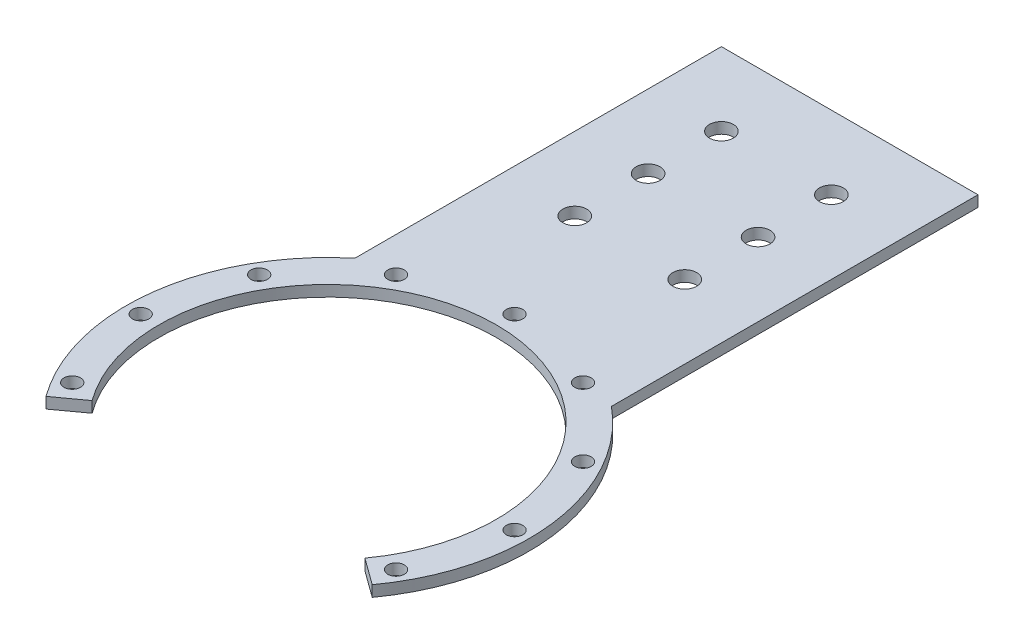
ISO-10303-21;
HEADER;
FILE_DESCRIPTION(('STEP AP214'),'2;1');
FILE_NAME('part.step','',(''),(''),'','','');
FILE_SCHEMA(('AUTOMOTIVE_DESIGN { 1 0 10303 214 1 1 1 1 }'));
ENDSEC;
DATA;
#1=APPLICATION_CONTEXT('core data for automotive mechanical design processes');
#2=APPLICATION_PROTOCOL_DEFINITION('international standard','automotive_design',2000,#1);
#3=PRODUCT_CONTEXT('',#1,'mechanical');
#4=PRODUCT('Part','Part','',(#3));
#5=PRODUCT_RELATED_PRODUCT_CATEGORY('part','',(#4));
#6=PRODUCT_DEFINITION_FORMATION('','',#4);
#7=PRODUCT_DEFINITION_CONTEXT('part definition',#1,'design');
#8=PRODUCT_DEFINITION('design','',#6,#7);
#9=PRODUCT_DEFINITION_SHAPE('','',#8);
#10=(LENGTH_UNIT() NAMED_UNIT(*) SI_UNIT(.MILLI.,.METRE.));
#11=(NAMED_UNIT(*) PLANE_ANGLE_UNIT() SI_UNIT($,.RADIAN.));
#12=(NAMED_UNIT(*) SI_UNIT($,.STERADIAN.) SOLID_ANGLE_UNIT());
#13=UNCERTAINTY_MEASURE_WITH_UNIT(LENGTH_MEASURE(1.E-05),#10,'distance_accuracy_value','');
#14=(GEOMETRIC_REPRESENTATION_CONTEXT(3) GLOBAL_UNCERTAINTY_ASSIGNED_CONTEXT((#13)) GLOBAL_UNIT_ASSIGNED_CONTEXT((#10,
#11,#12)) REPRESENTATION_CONTEXT('',''));
#15=CARTESIAN_POINT('',(0.,0.,0.));
#16=DIRECTION('',(0.,0.,1.));
#17=DIRECTION('',(1.,0.,0.));
#18=AXIS2_PLACEMENT_3D('',#15,#16,#17);
#19=CARTESIAN_POINT('',(-15.,-0.000287499999999594,-82.4264068711929));
#20=DIRECTION('',(0.,1.,0.));
#21=DIRECTION('',(0.,0.,1.));
#22=AXIS2_PLACEMENT_3D('',#19,#20,#21);
#23=CYLINDRICAL_SURFACE('',#22,3.25);
#24=CARTESIAN_POINT('',(-15.,3.,-82.4264068711929));
#25=DIRECTION('',(0.,1.,0.));
#26=DIRECTION('',(0.,0.,1.));
#27=AXIS2_PLACEMENT_3D('',#24,#25,#26);
#28=CIRCLE('',#27,3.25);
#29=CARTESIAN_POINT('',(-15.,3.,-79.1764068711929));
#30=VERTEX_POINT('',#29);
#31=EDGE_CURVE('E39',#30,#30,#28,.T.);
#32=ORIENTED_EDGE('',*,*,#31,.T.);
#33=EDGE_LOOP('',(#32));
#34=FACE_BOUND('',#33,.T.);
#35=CARTESIAN_POINT('',(-15.,0.,-82.4264068711929));
#36=DIRECTION('',(0.,1.,0.));
#37=DIRECTION('',(0.,0.,1.));
#38=AXIS2_PLACEMENT_3D('',#35,#36,#37);
#39=CIRCLE('',#38,3.25);
#40=CARTESIAN_POINT('',(-15.,0.,-79.1764068711929));
#41=VERTEX_POINT('',#40);
#42=EDGE_CURVE('E11',#41,#41,#39,.T.);
#43=ORIENTED_EDGE('',*,*,#42,.F.);
#44=EDGE_LOOP('',(#43));
#45=FACE_BOUND('',#44,.T.);
#46=ADVANCED_FACE('F32',(#34,#45),#23,.F.);
#47=CARTESIAN_POINT('',(15.,-0.000287499999999594,-82.4264068711929));
#48=DIRECTION('',(0.,1.,0.));
#49=DIRECTION('',(0.,0.,1.));
#50=AXIS2_PLACEMENT_3D('',#47,#48,#49);
#51=CYLINDRICAL_SURFACE('',#50,3.25);
#52=CARTESIAN_POINT('',(15.,3.,-82.4264068711929));
#53=DIRECTION('',(0.,1.,0.));
#54=DIRECTION('',(0.,0.,1.));
#55=AXIS2_PLACEMENT_3D('',#52,#53,#54);
#56=CIRCLE('',#55,3.25);
#57=CARTESIAN_POINT('',(15.,3.,-79.1764068711929));
#58=VERTEX_POINT('',#57);
#59=EDGE_CURVE('E143',#58,#58,#56,.T.);
#60=ORIENTED_EDGE('',*,*,#59,.T.);
#61=EDGE_LOOP('',(#60));
#62=FACE_BOUND('',#61,.T.);
#63=CARTESIAN_POINT('',(15.,0.,-82.4264068711929));
#64=DIRECTION('',(0.,1.,0.));
#65=DIRECTION('',(0.,0.,1.));
#66=AXIS2_PLACEMENT_3D('',#63,#64,#65);
#67=CIRCLE('',#66,3.25);
#68=CARTESIAN_POINT('',(15.,0.,-79.1764068711929));
#69=VERTEX_POINT('',#68);
#70=EDGE_CURVE('E145',#69,#69,#67,.T.);
#71=ORIENTED_EDGE('',*,*,#70,.F.);
#72=EDGE_LOOP('',(#71));
#73=FACE_BOUND('',#72,.T.);
#74=ADVANCED_FACE('F170',(#62,#73),#51,.F.);
#75=CARTESIAN_POINT('',(0.,3.,0.));
#76=DIRECTION('',(0.,-1.,0.));
#77=DIRECTION('',(0.,0.,-1.));
#78=AXIS2_PLACEMENT_3D('',#75,#76,#77);
#79=CYLINDRICAL_SURFACE('',#78,55.);
#80=DIRECTION('',(0.,1.,0.));
#81=VECTOR('',#80,1.);
#82=CARTESIAN_POINT('',(44.4959346906222,-2.49999999998515E-05,32.328188876086));
#83=LINE('',#82,#81);
#84=CARTESIAN_POINT('',(44.4959346906222,-6.24999999996288E-06,32.328188876086));
#85=VERTEX_POINT('',#84);
#86=CARTESIAN_POINT('',(44.4959346906222,3.,32.328188876086));
#87=VERTEX_POINT('',#86);
#88=EDGE_CURVE('E96',#85,#87,#83,.T.);
#89=ORIENTED_EDGE('',*,*,#88,.F.);
#90=CARTESIAN_POINT('',(0.,0.,0.));
#91=DIRECTION('',(0.,1.,0.));
#92=DIRECTION('',(0.,0.,1.));
#93=AXIS2_PLACEMENT_3D('',#90,#91,#92);
#94=CIRCLE('',#93,55.);
#95=CARTESIAN_POINT('',(35.,0.,-42.4264068711929));
#96=VERTEX_POINT('',#95);
#97=EDGE_CURVE('E125',#85,#96,#94,.T.);
#98=ORIENTED_EDGE('',*,*,#97,.T.);
#99=DIRECTION('',(0.,-1.,0.));
#100=VECTOR('',#99,1.);
#101=CARTESIAN_POINT('',(35.,3.,-42.4264068711929));
#102=LINE('',#101,#100);
#103=CARTESIAN_POINT('',(35.,3.,-42.4264068711929));
#104=VERTEX_POINT('',#103);
#105=EDGE_CURVE('E116',#104,#96,#102,.T.);
#106=ORIENTED_EDGE('',*,*,#105,.F.);
#107=CARTESIAN_POINT('',(0.,3.,0.));
#108=DIRECTION('',(0.,1.,0.));
#109=DIRECTION('',(0.,0.,1.));
#110=AXIS2_PLACEMENT_3D('',#107,#108,#109);
#111=CIRCLE('',#110,55.);
#112=EDGE_CURVE('E108',#87,#104,#111,.T.);
#113=ORIENTED_EDGE('',*,*,#112,.F.);
#114=EDGE_LOOP('',(#89,#98,#106,#113));
#115=FACE_BOUND('',#114,.T.);
#116=ADVANCED_FACE('F114',(#115),#79,.T.);
#117=CARTESIAN_POINT('',(0.,3.,0.));
#118=DIRECTION('',(0.,1.,0.));
#119=DIRECTION('',(0.,0.,1.));
#120=AXIS2_PLACEMENT_3D('',#117,#118,#119);
#121=PLANE('',#120);
#122=CARTESIAN_POINT('',(-15.,3.,-102.426406871193));
#123=DIRECTION('',(0.,1.,0.));
#124=DIRECTION('',(0.,0.,1.));
#125=AXIS2_PLACEMENT_3D('',#122,#123,#124);
#126=CIRCLE('',#125,3.25);
#127=CARTESIAN_POINT('',(-15.,3.,-99.1764068711929));
#128=VERTEX_POINT('',#127);
#129=EDGE_CURVE('E548',#128,#128,#126,.T.);
#130=ORIENTED_EDGE('',*,*,#129,.F.);
#131=EDGE_LOOP('',(#130));
#132=FACE_BOUND('',#131,.T.);
#133=CARTESIAN_POINT('',(15.,3.,-102.426406871193));
#134=DIRECTION('',(0.,1.,0.));
#135=DIRECTION('',(0.,0.,1.));
#136=AXIS2_PLACEMENT_3D('',#133,#134,#135);
#137=CIRCLE('',#136,3.25);
#138=CARTESIAN_POINT('',(15.,3.,-99.1764068711929));
#139=VERTEX_POINT('',#138);
#140=EDGE_CURVE('E446',#139,#139,#137,.T.);
#141=ORIENTED_EDGE('',*,*,#140,.F.);
#142=EDGE_LOOP('',(#141));
#143=FACE_BOUND('',#142,.T.);
#144=CARTESIAN_POINT('',(15.,3.,-122.426406871193));
#145=DIRECTION('',(0.,1.,0.));
#146=DIRECTION('',(0.,0.,1.));
#147=AXIS2_PLACEMENT_3D('',#144,#145,#146);
#148=CIRCLE('',#147,3.25);
#149=CARTESIAN_POINT('',(15.,3.,-119.176406871193));
#150=VERTEX_POINT('',#149);
#151=EDGE_CURVE('E410',#150,#150,#148,.T.);
#152=ORIENTED_EDGE('',*,*,#151,.F.);
#153=EDGE_LOOP('',(#152));
#154=FACE_BOUND('',#153,.T.);
#155=CARTESIAN_POINT('',(-15.,3.,-122.426406871193));
#156=DIRECTION('',(0.,1.,0.));
#157=DIRECTION('',(0.,0.,1.));
#158=AXIS2_PLACEMENT_3D('',#155,#156,#157);
#159=CIRCLE('',#158,3.25);
#160=CARTESIAN_POINT('',(-15.,3.,-119.176406871193));
#161=VERTEX_POINT('',#160);
#162=EDGE_CURVE('E439',#161,#161,#159,.T.);
#163=ORIENTED_EDGE('',*,*,#162,.F.);
#164=EDGE_LOOP('',(#163));
#165=FACE_BOUND('',#164,.T.);
#166=CARTESIAN_POINT('',(-44.1672955930064,3.,-25.4999999999999));
#167=DIRECTION('',(0.,1.,0.));
#168=DIRECTION('',(0.,0.,1.));
#169=AXIS2_PLACEMENT_3D('',#166,#167,#168);
#170=CIRCLE('',#169,2.25);
#171=CARTESIAN_POINT('',(-44.1672955930064,3.,-23.2499999999999));
#172=VERTEX_POINT('',#171);
#173=EDGE_CURVE('E405',#172,#172,#170,.T.);
#174=ORIENTED_EDGE('',*,*,#173,.F.);
#175=EDGE_LOOP('',(#174));
#176=FACE_BOUND('',#175,.T.);
#177=CARTESIAN_POINT('',(-51.,3.,1.78065548281E-13));
#178=DIRECTION('',(0.,1.,0.));
#179=DIRECTION('',(0.,0.,1.));
#180=AXIS2_PLACEMENT_3D('',#177,#178,#179);
#181=CIRCLE('',#180,2.25);
#182=CARTESIAN_POINT('',(-51.,3.,2.25000000000018));
#183=VERTEX_POINT('',#182);
#184=EDGE_CURVE('E434',#183,#183,#181,.T.);
#185=ORIENTED_EDGE('',*,*,#184,.F.);
#186=EDGE_LOOP('',(#185));
#187=FACE_BOUND('',#186,.T.);
#188=CARTESIAN_POINT('',(-44.1672955930063,3.,25.5000000000002));
#189=DIRECTION('',(0.,1.,0.));
#190=DIRECTION('',(0.,0.,1.));
#191=AXIS2_PLACEMENT_3D('',#188,#189,#190);
#192=CIRCLE('',#191,2.25);
#193=CARTESIAN_POINT('',(-44.1672955930063,3.,27.7500000000002));
#194=VERTEX_POINT('',#193);
#195=EDGE_CURVE('E430',#194,#194,#192,.T.);
#196=ORIENTED_EDGE('',*,*,#195,.F.);
#197=EDGE_LOOP('',(#196));
#198=FACE_BOUND('',#197,.T.);
#199=CARTESIAN_POINT('',(44.1672955930066,3.,25.4999999999996));
#200=DIRECTION('',(0.,1.,0.));
#201=DIRECTION('',(0.,0.,1.));
#202=AXIS2_PLACEMENT_3D('',#199,#200,#201);
#203=CIRCLE('',#202,2.25);
#204=CARTESIAN_POINT('',(44.1672955930066,3.,27.7499999999996));
#205=VERTEX_POINT('',#204);
#206=EDGE_CURVE('E426',#205,#205,#203,.T.);
#207=ORIENTED_EDGE('',*,*,#206,.F.);
#208=EDGE_LOOP('',(#207));
#209=FACE_BOUND('',#208,.T.);
#210=CARTESIAN_POINT('',(51.,3.,-5.34196644842999E-13));
#211=DIRECTION('',(0.,1.,0.));
#212=DIRECTION('',(0.,0.,1.));
#213=AXIS2_PLACEMENT_3D('',#210,#211,#212);
#214=CIRCLE('',#213,2.25);
#215=CARTESIAN_POINT('',(51.,3.,2.24999999999947));
#216=VERTEX_POINT('',#215);
#217=EDGE_CURVE('E422',#216,#216,#214,.T.);
#218=ORIENTED_EDGE('',*,*,#217,.F.);
#219=EDGE_LOOP('',(#218));
#220=FACE_BOUND('',#219,.T.);
#221=CARTESIAN_POINT('',(44.1672955930061,3.,-25.5000000000005));
#222=DIRECTION('',(0.,1.,0.));
#223=DIRECTION('',(0.,0.,1.));
#224=AXIS2_PLACEMENT_3D('',#221,#222,#223);
#225=CIRCLE('',#224,2.25);
#226=CARTESIAN_POINT('',(44.1672955930061,3.,-23.2500000000005));
#227=VERTEX_POINT('',#226);
#228=EDGE_CURVE('E418',#227,#227,#225,.T.);
#229=ORIENTED_EDGE('',*,*,#228,.F.);
#230=EDGE_LOOP('',(#229));
#231=FACE_BOUND('',#230,.T.);
#232=CARTESIAN_POINT('',(25.4999999999994,3.,-44.1672955930067));
#233=DIRECTION('',(0.,1.,0.));
#234=DIRECTION('',(0.,0.,1.));
#235=AXIS2_PLACEMENT_3D('',#232,#233,#234);
#236=CIRCLE('',#235,2.25);
#237=CARTESIAN_POINT('',(25.4999999999994,3.,-41.9172955930067));
#238=VERTEX_POINT('',#237);
#239=EDGE_CURVE('E414',#238,#238,#236,.T.);
#240=ORIENTED_EDGE('',*,*,#239,.F.);
#241=EDGE_LOOP('',(#240));
#242=FACE_BOUND('',#241,.T.);
#243=CARTESIAN_POINT('',(-25.5,3.,-44.1672955930063));
#244=DIRECTION('',(0.,1.,0.));
#245=DIRECTION('',(0.,0.,1.));
#246=AXIS2_PLACEMENT_3D('',#243,#244,#245);
#247=CIRCLE('',#246,2.25);
#248=CARTESIAN_POINT('',(-25.5,3.,-41.9172955930063));
#249=VERTEX_POINT('',#248);
#250=EDGE_CURVE('E409',#249,#249,#247,.T.);
#251=ORIENTED_EDGE('',*,*,#250,.F.);
#252=EDGE_LOOP('',(#251));
#253=FACE_BOUND('',#252,.T.);
#254=CARTESIAN_POINT('',(0.,3.,-51.));
#255=DIRECTION('',(0.,1.,0.));
#256=DIRECTION('',(0.,0.,1.));
#257=AXIS2_PLACEMENT_3D('',#254,#255,#256);
#258=CIRCLE('',#257,2.25);
#259=CARTESIAN_POINT('',(0.,3.,-48.75));
#260=VERTEX_POINT('',#259);
#261=EDGE_CURVE('E102',#260,#260,#258,.T.);
#262=ORIENTED_EDGE('',*,*,#261,.F.);
#263=EDGE_LOOP('',(#262));
#264=FACE_BOUND('',#263,.T.);
#265=CARTESIAN_POINT('',(0.,3.,0.));
#266=DIRECTION('',(0.,1.,0.));
#267=DIRECTION('',(0.,0.,1.));
#268=AXIS2_PLACEMENT_3D('',#265,#266,#267);
#269=CIRCLE('',#268,46.);
#270=CARTESIAN_POINT('',(37.2147817412476,3.,27.0381216054537));
#271=VERTEX_POINT('',#270);
#272=CARTESIAN_POINT('',(-37.2147817412476,3.,27.0381216054537));
#273=VERTEX_POINT('',#272);
#274=EDGE_CURVE('E111',#271,#273,#269,.T.);
#275=ORIENTED_EDGE('',*,*,#274,.F.);
#276=DIRECTION('',(0.809016994374949,0.,0.587785252292472));
#277=VECTOR('',#276,1.);
#278=CARTESIAN_POINT('',(0.,3.,0.));
#279=LINE('',#278,#277);
#280=EDGE_CURVE('E46',#271,#87,#279,.T.);
#281=ORIENTED_EDGE('',*,*,#280,.T.);
#282=ORIENTED_EDGE('',*,*,#112,.T.);
#283=DIRECTION('',(0.,0.,-1.));
#284=VECTOR('',#283,1.);
#285=CARTESIAN_POINT('',(35.,3.,-142.426406871193));
#286=LINE('',#285,#284);
#287=CARTESIAN_POINT('',(35.,3.,-142.426406871193));
#288=VERTEX_POINT('',#287);
#289=EDGE_CURVE('E392',#104,#288,#286,.T.);
#290=ORIENTED_EDGE('',*,*,#289,.T.);
#291=DIRECTION('',(-1.,0.,0.));
#292=VECTOR('',#291,1.);
#293=CARTESIAN_POINT('',(-35.,3.,-142.426406871193));
#294=LINE('',#293,#292);
#295=CARTESIAN_POINT('',(-35.,3.,-142.426406871193));
#296=VERTEX_POINT('',#295);
#297=EDGE_CURVE('E396',#288,#296,#294,.T.);
#298=ORIENTED_EDGE('',*,*,#297,.T.);
#299=DIRECTION('',(0.,0.,1.));
#300=VECTOR('',#299,1.);
#301=CARTESIAN_POINT('',(-35.,3.,-142.426406871193));
#302=LINE('',#301,#300);
#303=CARTESIAN_POINT('',(-35.,3.,-42.4264068711929));
#304=VERTEX_POINT('',#303);
#305=EDGE_CURVE('E490',#296,#304,#302,.T.);
#306=ORIENTED_EDGE('',*,*,#305,.T.);
#307=CARTESIAN_POINT('',(-44.4959346906222,3.,32.328188876086));
#308=VERTEX_POINT('',#307);
#309=EDGE_CURVE('E118',#304,#308,#111,.T.);
#310=ORIENTED_EDGE('',*,*,#309,.T.);
#311=DIRECTION('',(-0.809016994374949,0.,0.587785252292472));
#312=VECTOR('',#311,1.);
#313=CARTESIAN_POINT('',(0.,3.,0.));
#314=LINE('',#313,#312);
#315=EDGE_CURVE('E482',#273,#308,#314,.T.);
#316=ORIENTED_EDGE('',*,*,#315,.F.);
#317=EDGE_LOOP('',(#275,#281,#282,#290,#298,#306,#310,#316));
#318=FACE_BOUND('',#317,.T.);
#319=ORIENTED_EDGE('',*,*,#59,.F.);
#320=EDGE_LOOP('',(#319));
#321=FACE_BOUND('',#320,.T.);
#322=ORIENTED_EDGE('',*,*,#31,.F.);
#323=EDGE_LOOP('',(#322));
#324=FACE_BOUND('',#323,.T.);
#325=ADVANCED_FACE('F106',(#132,#143,#154,#165,#176,#187,#198,#209,#220,#231,#242,#253,#264,
#318,#321,#324),#121,.T.);
#326=CARTESIAN_POINT('',(0.,0.,0.));
#327=DIRECTION('',(0.,1.,0.));
#328=DIRECTION('',(0.,0.,1.));
#329=AXIS2_PLACEMENT_3D('',#326,#327,#328);
#330=PLANE('',#329);
#331=CARTESIAN_POINT('',(-15.,0.,-102.426406871193));
#332=DIRECTION('',(0.,1.,0.));
#333=DIRECTION('',(0.,0.,1.));
#334=AXIS2_PLACEMENT_3D('',#331,#332,#333);
#335=CIRCLE('',#334,3.25);
#336=CARTESIAN_POINT('',(-15.,0.,-99.1764068711929));
#337=VERTEX_POINT('',#336);
#338=EDGE_CURVE('E451',#337,#337,#335,.T.);
#339=ORIENTED_EDGE('',*,*,#338,.T.);
#340=EDGE_LOOP('',(#339));
#341=FACE_BOUND('',#340,.T.);
#342=CARTESIAN_POINT('',(15.,0.,-102.426406871193));
#343=DIRECTION('',(0.,1.,0.));
#344=DIRECTION('',(0.,0.,1.));
#345=AXIS2_PLACEMENT_3D('',#342,#343,#344);
#346=CIRCLE('',#345,3.25);
#347=CARTESIAN_POINT('',(15.,0.,-99.1764068711929));
#348=VERTEX_POINT('',#347);
#349=EDGE_CURVE('E440',#348,#348,#346,.T.);
#350=ORIENTED_EDGE('',*,*,#349,.T.);
#351=EDGE_LOOP('',(#350));
#352=FACE_BOUND('',#351,.T.);
#353=CARTESIAN_POINT('',(15.,0.,-122.426406871193));
#354=DIRECTION('',(0.,1.,0.));
#355=DIRECTION('',(0.,0.,1.));
#356=AXIS2_PLACEMENT_3D('',#353,#354,#355);
#357=CIRCLE('',#356,3.25);
#358=CARTESIAN_POINT('',(15.,0.,-119.176406871193));
#359=VERTEX_POINT('',#358);
#360=EDGE_CURVE('E152',#359,#359,#357,.T.);
#361=ORIENTED_EDGE('',*,*,#360,.T.);
#362=EDGE_LOOP('',(#361));
#363=FACE_BOUND('',#362,.T.);
#364=CARTESIAN_POINT('',(-15.,0.,-122.426406871193));
#365=DIRECTION('',(0.,1.,0.));
#366=DIRECTION('',(0.,0.,1.));
#367=AXIS2_PLACEMENT_3D('',#364,#365,#366);
#368=CIRCLE('',#367,3.25);
#369=CARTESIAN_POINT('',(-15.,0.,-119.176406871193));
#370=VERTEX_POINT('',#369);
#371=EDGE_CURVE('E437',#370,#370,#368,.T.);
#372=ORIENTED_EDGE('',*,*,#371,.T.);
#373=EDGE_LOOP('',(#372));
#374=FACE_BOUND('',#373,.T.);
#375=CARTESIAN_POINT('',(-44.1672955930064,0.,-25.4999999999999));
#376=DIRECTION('',(0.,1.,0.));
#377=DIRECTION('',(0.,0.,1.));
#378=AXIS2_PLACEMENT_3D('',#375,#376,#377);
#379=CIRCLE('',#378,2.25);
#380=CARTESIAN_POINT('',(-44.1672955930064,0.,-23.2499999999999));
#381=VERTEX_POINT('',#380);
#382=EDGE_CURVE('E435',#381,#381,#379,.T.);
#383=ORIENTED_EDGE('',*,*,#382,.T.);
#384=EDGE_LOOP('',(#383));
#385=FACE_BOUND('',#384,.T.);
#386=CARTESIAN_POINT('',(-51.,0.,1.78065548281E-13));
#387=DIRECTION('',(0.,1.,0.));
#388=DIRECTION('',(0.,0.,1.));
#389=AXIS2_PLACEMENT_3D('',#386,#387,#388);
#390=CIRCLE('',#389,2.25);
#391=CARTESIAN_POINT('',(-51.,0.,2.25000000000018));
#392=VERTEX_POINT('',#391);
#393=EDGE_CURVE('E431',#392,#392,#390,.T.);
#394=ORIENTED_EDGE('',*,*,#393,.T.);
#395=EDGE_LOOP('',(#394));
#396=FACE_BOUND('',#395,.T.);
#397=CARTESIAN_POINT('',(-44.1672955930063,0.,25.5000000000002));
#398=DIRECTION('',(0.,1.,0.));
#399=DIRECTION('',(0.,0.,1.));
#400=AXIS2_PLACEMENT_3D('',#397,#398,#399);
#401=CIRCLE('',#400,2.25);
#402=CARTESIAN_POINT('',(-44.1672955930063,0.,27.7500000000002));
#403=VERTEX_POINT('',#402);
#404=EDGE_CURVE('E427',#403,#403,#401,.T.);
#405=ORIENTED_EDGE('',*,*,#404,.T.);
#406=EDGE_LOOP('',(#405));
#407=FACE_BOUND('',#406,.T.);
#408=CARTESIAN_POINT('',(44.1672955930066,0.,25.4999999999996));
#409=DIRECTION('',(0.,1.,0.));
#410=DIRECTION('',(0.,0.,1.));
#411=AXIS2_PLACEMENT_3D('',#408,#409,#410);
#412=CIRCLE('',#411,2.25);
#413=CARTESIAN_POINT('',(44.1672955930066,0.,27.7499999999996));
#414=VERTEX_POINT('',#413);
#415=EDGE_CURVE('E423',#414,#414,#412,.T.);
#416=ORIENTED_EDGE('',*,*,#415,.T.);
#417=EDGE_LOOP('',(#416));
#418=FACE_BOUND('',#417,.T.);
#419=CARTESIAN_POINT('',(51.,0.,-5.34196644842999E-13));
#420=DIRECTION('',(0.,1.,0.));
#421=DIRECTION('',(0.,0.,1.));
#422=AXIS2_PLACEMENT_3D('',#419,#420,#421);
#423=CIRCLE('',#422,2.25);
#424=CARTESIAN_POINT('',(51.,0.,2.24999999999947));
#425=VERTEX_POINT('',#424);
#426=EDGE_CURVE('E419',#425,#425,#423,.T.);
#427=ORIENTED_EDGE('',*,*,#426,.T.);
#428=EDGE_LOOP('',(#427));
#429=FACE_BOUND('',#428,.T.);
#430=CARTESIAN_POINT('',(44.1672955930061,0.,-25.5000000000005));
#431=DIRECTION('',(0.,1.,0.));
#432=DIRECTION('',(0.,0.,1.));
#433=AXIS2_PLACEMENT_3D('',#430,#431,#432);
#434=CIRCLE('',#433,2.25);
#435=CARTESIAN_POINT('',(44.1672955930061,0.,-23.2500000000005));
#436=VERTEX_POINT('',#435);
#437=EDGE_CURVE('E415',#436,#436,#434,.T.);
#438=ORIENTED_EDGE('',*,*,#437,.T.);
#439=EDGE_LOOP('',(#438));
#440=FACE_BOUND('',#439,.T.);
#441=CARTESIAN_POINT('',(25.4999999999994,0.,-44.1672955930067));
#442=DIRECTION('',(0.,1.,0.));
#443=DIRECTION('',(0.,0.,1.));
#444=AXIS2_PLACEMENT_3D('',#441,#442,#443);
#445=CIRCLE('',#444,2.25);
#446=CARTESIAN_POINT('',(25.4999999999994,0.,-41.9172955930067));
#447=VERTEX_POINT('',#446);
#448=EDGE_CURVE('E411',#447,#447,#445,.T.);
#449=ORIENTED_EDGE('',*,*,#448,.T.);
#450=EDGE_LOOP('',(#449));
#451=FACE_BOUND('',#450,.T.);
#452=CARTESIAN_POINT('',(-25.5,0.,-44.1672955930063));
#453=DIRECTION('',(0.,1.,0.));
#454=DIRECTION('',(0.,0.,1.));
#455=AXIS2_PLACEMENT_3D('',#452,#453,#454);
#456=CIRCLE('',#455,2.25);
#457=CARTESIAN_POINT('',(-25.5,0.,-41.9172955930063));
#458=VERTEX_POINT('',#457);
#459=EDGE_CURVE('E406',#458,#458,#456,.T.);
#460=ORIENTED_EDGE('',*,*,#459,.T.);
#461=EDGE_LOOP('',(#460));
#462=FACE_BOUND('',#461,.T.);
#463=CARTESIAN_POINT('',(0.,0.,-51.));
#464=DIRECTION('',(0.,1.,0.));
#465=DIRECTION('',(0.,0.,1.));
#466=AXIS2_PLACEMENT_3D('',#463,#464,#465);
#467=CIRCLE('',#466,2.25);
#468=CARTESIAN_POINT('',(0.,0.,-48.75));
#469=VERTEX_POINT('',#468);
#470=EDGE_CURVE('E402',#469,#469,#467,.T.);
#471=ORIENTED_EDGE('',*,*,#470,.T.);
#472=EDGE_LOOP('',(#471));
#473=FACE_BOUND('',#472,.T.);
#474=DIRECTION('',(0.809016994374949,0.,0.587785252292472));
#475=VECTOR('',#474,1.);
#476=CARTESIAN_POINT('',(0.,0.,0.));
#477=LINE('',#476,#475);
#478=CARTESIAN_POINT('',(37.2147817412476,0.,27.0381216054537));
#479=VERTEX_POINT('',#478);
#480=EDGE_CURVE('E98',#479,#85,#477,.T.);
#481=ORIENTED_EDGE('',*,*,#480,.F.);
#482=CARTESIAN_POINT('',(0.,0.,0.));
#483=DIRECTION('',(0.,1.,0.));
#484=DIRECTION('',(0.,0.,1.));
#485=AXIS2_PLACEMENT_3D('',#482,#483,#484);
#486=CIRCLE('',#485,46.);
#487=CARTESIAN_POINT('',(-37.2147817412476,0.,27.0381216054537));
#488=VERTEX_POINT('',#487);
#489=EDGE_CURVE('E54',#479,#488,#486,.T.);
#490=ORIENTED_EDGE('',*,*,#489,.T.);
#491=DIRECTION('',(-0.809016994374949,0.,0.587785252292472));
#492=VECTOR('',#491,1.);
#493=CARTESIAN_POINT('',(0.,0.,0.));
#494=LINE('',#493,#492);
#495=CARTESIAN_POINT('',(-44.4959346906222,0.,32.328188876086));
#496=VERTEX_POINT('',#495);
#497=EDGE_CURVE('E112',#488,#496,#494,.T.);
#498=ORIENTED_EDGE('',*,*,#497,.T.);
#499=CARTESIAN_POINT('',(-35.,0.,-42.4264068711929));
#500=VERTEX_POINT('',#499);
#501=EDGE_CURVE('E119',#500,#496,#94,.T.);
#502=ORIENTED_EDGE('',*,*,#501,.F.);
#503=DIRECTION('',(0.,0.,1.));
#504=VECTOR('',#503,1.);
#505=CARTESIAN_POINT('',(-35.,0.,-142.426406871193));
#506=LINE('',#505,#504);
#507=CARTESIAN_POINT('',(-35.,0.,-142.426406871193));
#508=VERTEX_POINT('',#507);
#509=EDGE_CURVE('E385',#508,#500,#506,.T.);
#510=ORIENTED_EDGE('',*,*,#509,.F.);
#511=DIRECTION('',(-1.,0.,0.));
#512=VECTOR('',#511,1.);
#513=CARTESIAN_POINT('',(-35.,0.,-142.426406871193));
#514=LINE('',#513,#512);
#515=CARTESIAN_POINT('',(35.,0.,-142.426406871193));
#516=VERTEX_POINT('',#515);
#517=EDGE_CURVE('E379',#516,#508,#514,.T.);
#518=ORIENTED_EDGE('',*,*,#517,.F.);
#519=DIRECTION('',(0.,0.,-1.));
#520=VECTOR('',#519,1.);
#521=CARTESIAN_POINT('',(35.,0.,-142.426406871193));
#522=LINE('',#521,#520);
#523=EDGE_CURVE('E388',#96,#516,#522,.T.);
#524=ORIENTED_EDGE('',*,*,#523,.F.);
#525=ORIENTED_EDGE('',*,*,#97,.F.);
#526=EDGE_LOOP('',(#481,#490,#498,#502,#510,#518,#524,#525));
#527=FACE_BOUND('',#526,.T.);
#528=ORIENTED_EDGE('',*,*,#70,.T.);
#529=EDGE_LOOP('',(#528));
#530=FACE_BOUND('',#529,.T.);
#531=ORIENTED_EDGE('',*,*,#42,.T.);
#532=EDGE_LOOP('',(#531));
#533=FACE_BOUND('',#532,.T.);
#534=ADVANCED_FACE('F160',(#341,#352,#363,#374,#385,#396,#407,#418,#429,#440,#451,#462,#473,
#527,#530,#533),#330,.F.);
#535=CARTESIAN_POINT('',(0.,0.,0.));
#536=DIRECTION('',(0.,1.,0.));
#537=DIRECTION('',(0.,0.,1.));
#538=AXIS2_PLACEMENT_3D('',#535,#536,#537);
#539=CYLINDRICAL_SURFACE('',#538,46.);
#540=DIRECTION('',(0.,1.,0.));
#541=VECTOR('',#540,1.);
#542=CARTESIAN_POINT('',(37.2147817412476,0.,27.0381216054537));
#543=LINE('',#542,#541);
#544=EDGE_CURVE('E130',#271,#479,#543,.F.);
#545=ORIENTED_EDGE('',*,*,#544,.F.);
#546=ORIENTED_EDGE('',*,*,#274,.T.);
#547=DIRECTION('',(0.,1.,0.));
#548=VECTOR('',#547,1.);
#549=CARTESIAN_POINT('',(-37.2147817412476,0.,27.0381216054537));
#550=LINE('',#549,#548);
#551=EDGE_CURVE('E122',#273,#488,#550,.F.);
#552=ORIENTED_EDGE('',*,*,#551,.T.);
#553=ORIENTED_EDGE('',*,*,#489,.F.);
#554=EDGE_LOOP('',(#545,#546,#552,#553));
#555=FACE_BOUND('',#554,.T.);
#556=ADVANCED_FACE('F167',(#555),#539,.F.);
#557=ORIENTED_EDGE('',*,*,#501,.T.);
#558=DIRECTION('',(0.,1.,0.));
#559=VECTOR('',#558,1.);
#560=CARTESIAN_POINT('',(-44.4959346906222,0.,32.328188876086));
#561=LINE('',#560,#559);
#562=EDGE_CURVE('E479',#496,#308,#561,.T.);
#563=ORIENTED_EDGE('',*,*,#562,.T.);
#564=ORIENTED_EDGE('',*,*,#309,.F.);
#565=DIRECTION('',(0.,-1.,0.));
#566=VECTOR('',#565,1.);
#567=CARTESIAN_POINT('',(-35.,3.,-42.4264068711929));
#568=LINE('',#567,#566);
#569=EDGE_CURVE('E398',#304,#500,#568,.T.);
#570=ORIENTED_EDGE('',*,*,#569,.T.);
#571=EDGE_LOOP('',(#557,#563,#564,#570));
#572=FACE_BOUND('',#571,.T.);
#573=ADVANCED_FACE('F172',(#572),#79,.T.);
#574=CARTESIAN_POINT('',(-35.,3.,-142.426406871193));
#575=DIRECTION('',(0.,0.,1.));
#576=DIRECTION('',(1.,0.,0.));
#577=AXIS2_PLACEMENT_3D('',#574,#575,#576);
#578=PLANE('',#577);
#579=ORIENTED_EDGE('',*,*,#517,.T.);
#580=DIRECTION('',(0.,-1.,0.));
#581=VECTOR('',#580,1.);
#582=CARTESIAN_POINT('',(-35.,3.,-142.426406871193));
#583=LINE('',#582,#581);
#584=EDGE_CURVE('E135',#296,#508,#583,.T.);
#585=ORIENTED_EDGE('',*,*,#584,.F.);
#586=ORIENTED_EDGE('',*,*,#297,.F.);
#587=DIRECTION('',(0.,-1.,0.));
#588=VECTOR('',#587,1.);
#589=CARTESIAN_POINT('',(35.,3.,-142.426406871193));
#590=LINE('',#589,#588);
#591=EDGE_CURVE('E383',#288,#516,#590,.T.);
#592=ORIENTED_EDGE('',*,*,#591,.T.);
#593=EDGE_LOOP('',(#579,#585,#586,#592));
#594=FACE_BOUND('',#593,.T.);
#595=ADVANCED_FACE('F368',(#594),#578,.F.);
#596=CARTESIAN_POINT('',(-35.,3.,-142.426406871193));
#597=DIRECTION('',(1.,0.,0.));
#598=DIRECTION('',(0.,0.,-1.));
#599=AXIS2_PLACEMENT_3D('',#596,#597,#598);
#600=PLANE('',#599);
#601=ORIENTED_EDGE('',*,*,#509,.T.);
#602=ORIENTED_EDGE('',*,*,#569,.F.);
#603=ORIENTED_EDGE('',*,*,#305,.F.);
#604=ORIENTED_EDGE('',*,*,#584,.T.);
#605=EDGE_LOOP('',(#601,#602,#603,#604));
#606=FACE_BOUND('',#605,.T.);
#607=ADVANCED_FACE('F365',(#606),#600,.F.);
#608=CARTESIAN_POINT('',(35.,3.,-142.426406871193));
#609=DIRECTION('',(-1.,0.,0.));
#610=DIRECTION('',(0.,0.,1.));
#611=AXIS2_PLACEMENT_3D('',#608,#609,#610);
#612=PLANE('',#611);
#613=ORIENTED_EDGE('',*,*,#523,.T.);
#614=ORIENTED_EDGE('',*,*,#591,.F.);
#615=ORIENTED_EDGE('',*,*,#289,.F.);
#616=ORIENTED_EDGE('',*,*,#105,.T.);
#617=EDGE_LOOP('',(#613,#614,#615,#616));
#618=FACE_BOUND('',#617,.T.);
#619=ADVANCED_FACE('F360',(#618),#612,.F.);
#620=CARTESIAN_POINT('',(0.,0.,0.));
#621=DIRECTION('',(-0.587785252292472,0.,-0.809016994374948));
#622=DIRECTION('',(-0.809016994374949,0.,0.587785252292472));
#623=AXIS2_PLACEMENT_3D('',#620,#621,#622);
#624=PLANE('',#623);
#625=ORIENTED_EDGE('',*,*,#315,.T.);
#626=ORIENTED_EDGE('',*,*,#562,.F.);
#627=ORIENTED_EDGE('',*,*,#497,.F.);
#628=ORIENTED_EDGE('',*,*,#551,.F.);
#629=EDGE_LOOP('',(#625,#626,#627,#628));
#630=FACE_BOUND('',#629,.T.);
#631=ADVANCED_FACE('F199',(#630),#624,.F.);
#632=CARTESIAN_POINT('',(0.,-2.49999999998515E-05,0.));
#633=DIRECTION('',(-0.587785252292472,0.,0.809016994374948));
#634=DIRECTION('',(0.809016994374949,0.,0.587785252292472));
#635=AXIS2_PLACEMENT_3D('',#632,#633,#634);
#636=PLANE('',#635);
#637=ORIENTED_EDGE('',*,*,#544,.T.);
#638=ORIENTED_EDGE('',*,*,#480,.T.);
#639=ORIENTED_EDGE('',*,*,#88,.T.);
#640=ORIENTED_EDGE('',*,*,#280,.F.);
#641=EDGE_LOOP('',(#637,#638,#639,#640));
#642=FACE_BOUND('',#641,.T.);
#643=ADVANCED_FACE('F97',(#642),#636,.T.);
#644=CARTESIAN_POINT('',(0.,-0.000287499999999594,-51.));
#645=DIRECTION('',(0.,1.,0.));
#646=DIRECTION('',(0.,0.,1.));
#647=AXIS2_PLACEMENT_3D('',#644,#645,#646);
#648=CYLINDRICAL_SURFACE('',#647,2.25);
#649=ORIENTED_EDGE('',*,*,#261,.T.);
#650=EDGE_LOOP('',(#649));
#651=FACE_BOUND('',#650,.T.);
#652=ORIENTED_EDGE('',*,*,#470,.F.);
#653=EDGE_LOOP('',(#652));
#654=FACE_BOUND('',#653,.T.);
#655=ADVANCED_FACE('F217',(#651,#654),#648,.F.);
#656=CARTESIAN_POINT('',(-25.5,-0.000287499999999594,-44.1672955930063));
#657=DIRECTION('',(0.,1.,0.));
#658=DIRECTION('',(0.,0.,1.));
#659=AXIS2_PLACEMENT_3D('',#656,#657,#658);
#660=CYLINDRICAL_SURFACE('',#659,2.25);
#661=ORIENTED_EDGE('',*,*,#250,.T.);
#662=EDGE_LOOP('',(#661));
#663=FACE_BOUND('',#662,.T.);
#664=ORIENTED_EDGE('',*,*,#459,.F.);
#665=EDGE_LOOP('',(#664));
#666=FACE_BOUND('',#665,.T.);
#667=ADVANCED_FACE('F226',(#663,#666),#660,.F.);
#668=CARTESIAN_POINT('',(25.4999999999994,-0.000287499999999594,-44.1672955930067));
#669=DIRECTION('',(0.,1.,0.));
#670=DIRECTION('',(0.,0.,1.));
#671=AXIS2_PLACEMENT_3D('',#668,#669,#670);
#672=CYLINDRICAL_SURFACE('',#671,2.25);
#673=ORIENTED_EDGE('',*,*,#239,.T.);
#674=EDGE_LOOP('',(#673));
#675=FACE_BOUND('',#674,.T.);
#676=ORIENTED_EDGE('',*,*,#448,.F.);
#677=EDGE_LOOP('',(#676));
#678=FACE_BOUND('',#677,.T.);
#679=ADVANCED_FACE('F236',(#675,#678),#672,.F.);
#680=CARTESIAN_POINT('',(44.1672955930061,-0.000287499999999594,-25.5000000000005));
#681=DIRECTION('',(0.,1.,0.));
#682=DIRECTION('',(0.,0.,1.));
#683=AXIS2_PLACEMENT_3D('',#680,#681,#682);
#684=CYLINDRICAL_SURFACE('',#683,2.25);
#685=ORIENTED_EDGE('',*,*,#228,.T.);
#686=EDGE_LOOP('',(#685));
#687=FACE_BOUND('',#686,.T.);
#688=ORIENTED_EDGE('',*,*,#437,.F.);
#689=EDGE_LOOP('',(#688));
#690=FACE_BOUND('',#689,.T.);
#691=ADVANCED_FACE('F246',(#687,#690),#684,.F.);
#692=CARTESIAN_POINT('',(51.,-0.000287499999999594,-5.34196644842999E-13));
#693=DIRECTION('',(0.,1.,0.));
#694=DIRECTION('',(0.,0.,1.));
#695=AXIS2_PLACEMENT_3D('',#692,#693,#694);
#696=CYLINDRICAL_SURFACE('',#695,2.25);
#697=ORIENTED_EDGE('',*,*,#217,.T.);
#698=EDGE_LOOP('',(#697));
#699=FACE_BOUND('',#698,.T.);
#700=ORIENTED_EDGE('',*,*,#426,.F.);
#701=EDGE_LOOP('',(#700));
#702=FACE_BOUND('',#701,.T.);
#703=ADVANCED_FACE('F256',(#699,#702),#696,.F.);
#704=CARTESIAN_POINT('',(44.1672955930066,-0.000287499999999594,25.4999999999996));
#705=DIRECTION('',(0.,1.,0.));
#706=DIRECTION('',(0.,0.,1.));
#707=AXIS2_PLACEMENT_3D('',#704,#705,#706);
#708=CYLINDRICAL_SURFACE('',#707,2.25);
#709=ORIENTED_EDGE('',*,*,#206,.T.);
#710=EDGE_LOOP('',(#709));
#711=FACE_BOUND('',#710,.T.);
#712=ORIENTED_EDGE('',*,*,#415,.F.);
#713=EDGE_LOOP('',(#712));
#714=FACE_BOUND('',#713,.T.);
#715=ADVANCED_FACE('F266',(#711,#714),#708,.F.);
#716=CARTESIAN_POINT('',(-44.1672955930063,-0.000287499999999594,25.5000000000002));
#717=DIRECTION('',(0.,1.,0.));
#718=DIRECTION('',(0.,0.,1.));
#719=AXIS2_PLACEMENT_3D('',#716,#717,#718);
#720=CYLINDRICAL_SURFACE('',#719,2.25);
#721=ORIENTED_EDGE('',*,*,#195,.T.);
#722=EDGE_LOOP('',(#721));
#723=FACE_BOUND('',#722,.T.);
#724=ORIENTED_EDGE('',*,*,#404,.F.);
#725=EDGE_LOOP('',(#724));
#726=FACE_BOUND('',#725,.T.);
#727=ADVANCED_FACE('F276',(#723,#726),#720,.F.);
#728=CARTESIAN_POINT('',(-51.,-0.000287499999999594,1.78065548281E-13));
#729=DIRECTION('',(0.,1.,0.));
#730=DIRECTION('',(0.,0.,1.));
#731=AXIS2_PLACEMENT_3D('',#728,#729,#730);
#732=CYLINDRICAL_SURFACE('',#731,2.25);
#733=ORIENTED_EDGE('',*,*,#184,.T.);
#734=EDGE_LOOP('',(#733));
#735=FACE_BOUND('',#734,.T.);
#736=ORIENTED_EDGE('',*,*,#393,.F.);
#737=EDGE_LOOP('',(#736));
#738=FACE_BOUND('',#737,.T.);
#739=ADVANCED_FACE('F286',(#735,#738),#732,.F.);
#740=CARTESIAN_POINT('',(-44.1672955930064,-0.000287499999999594,-25.4999999999999));
#741=DIRECTION('',(0.,1.,0.));
#742=DIRECTION('',(0.,0.,1.));
#743=AXIS2_PLACEMENT_3D('',#740,#741,#742);
#744=CYLINDRICAL_SURFACE('',#743,2.25);
#745=ORIENTED_EDGE('',*,*,#173,.T.);
#746=EDGE_LOOP('',(#745));
#747=FACE_BOUND('',#746,.T.);
#748=ORIENTED_EDGE('',*,*,#382,.F.);
#749=EDGE_LOOP('',(#748));
#750=FACE_BOUND('',#749,.T.);
#751=ADVANCED_FACE('F296',(#747,#750),#744,.F.);
#752=CARTESIAN_POINT('',(-15.,-0.000287499999999594,-122.426406871193));
#753=DIRECTION('',(0.,1.,0.));
#754=DIRECTION('',(0.,0.,1.));
#755=AXIS2_PLACEMENT_3D('',#752,#753,#754);
#756=CYLINDRICAL_SURFACE('',#755,3.25);
#757=ORIENTED_EDGE('',*,*,#162,.T.);
#758=EDGE_LOOP('',(#757));
#759=FACE_BOUND('',#758,.T.);
#760=ORIENTED_EDGE('',*,*,#371,.F.);
#761=EDGE_LOOP('',(#760));
#762=FACE_BOUND('',#761,.T.);
#763=ADVANCED_FACE('F306',(#759,#762),#756,.F.);
#764=CARTESIAN_POINT('',(15.,-0.000287499999999594,-122.426406871193));
#765=DIRECTION('',(0.,1.,0.));
#766=DIRECTION('',(0.,0.,1.));
#767=AXIS2_PLACEMENT_3D('',#764,#765,#766);
#768=CYLINDRICAL_SURFACE('',#767,3.25);
#769=ORIENTED_EDGE('',*,*,#151,.T.);
#770=EDGE_LOOP('',(#769));
#771=FACE_BOUND('',#770,.T.);
#772=ORIENTED_EDGE('',*,*,#360,.F.);
#773=EDGE_LOOP('',(#772));
#774=FACE_BOUND('',#773,.T.);
#775=ADVANCED_FACE('F316',(#771,#774),#768,.F.);
#776=CARTESIAN_POINT('',(15.,-0.000287499999999594,-102.426406871193));
#777=DIRECTION('',(0.,1.,0.));
#778=DIRECTION('',(0.,0.,1.));
#779=AXIS2_PLACEMENT_3D('',#776,#777,#778);
#780=CYLINDRICAL_SURFACE('',#779,3.25);
#781=ORIENTED_EDGE('',*,*,#140,.T.);
#782=EDGE_LOOP('',(#781));
#783=FACE_BOUND('',#782,.T.);
#784=ORIENTED_EDGE('',*,*,#349,.F.);
#785=EDGE_LOOP('',(#784));
#786=FACE_BOUND('',#785,.T.);
#787=ADVANCED_FACE('F325',(#783,#786),#780,.F.);
#788=CARTESIAN_POINT('',(-15.,-0.000287499999999594,-102.426406871193));
#789=DIRECTION('',(0.,1.,0.));
#790=DIRECTION('',(0.,0.,1.));
#791=AXIS2_PLACEMENT_3D('',#788,#789,#790);
#792=CYLINDRICAL_SURFACE('',#791,3.25);
#793=ORIENTED_EDGE('',*,*,#129,.T.);
#794=EDGE_LOOP('',(#793));
#795=FACE_BOUND('',#794,.T.);
#796=ORIENTED_EDGE('',*,*,#338,.F.);
#797=EDGE_LOOP('',(#796));
#798=FACE_BOUND('',#797,.T.);
#799=ADVANCED_FACE('F343',(#795,#798),#792,.F.);
#800=CLOSED_SHELL('',(#46,#74,#116,#325,#534,#556,#573,#595,#607,#619,#631,#643,#655,#667,#679,
#691,#703,#715,#727,#739,#751,#763,#775,#787,#799));
#801=MANIFOLD_SOLID_BREP('B2',#800);
#802=ADVANCED_BREP_SHAPE_REPRESENTATION('',(#18,#801),#14);
#803=SHAPE_DEFINITION_REPRESENTATION(#9,#802);
ENDSEC;
END-ISO-10303-21;
